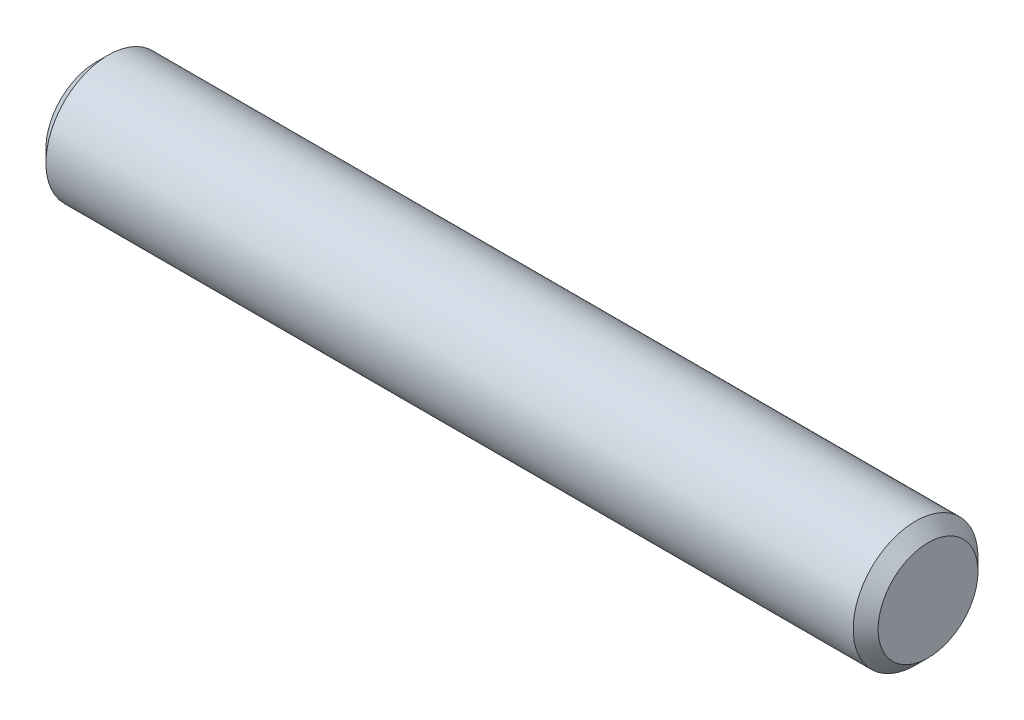
ISO-10303-21;
HEADER;
FILE_DESCRIPTION(('STEP AP214'),'2;1');
FILE_NAME('part.step','',(''),(''),'','','');
FILE_SCHEMA(('AUTOMOTIVE_DESIGN { 1 0 10303 214 1 1 1 1 }'));
ENDSEC;
DATA;
#1=APPLICATION_CONTEXT('core data for automotive mechanical design processes');
#2=APPLICATION_PROTOCOL_DEFINITION('international standard','automotive_design',2000,#1);
#3=PRODUCT_CONTEXT('',#1,'mechanical');
#4=PRODUCT('Part','Part','',(#3));
#5=PRODUCT_RELATED_PRODUCT_CATEGORY('part','',(#4));
#6=PRODUCT_DEFINITION_FORMATION('','',#4);
#7=PRODUCT_DEFINITION_CONTEXT('part definition',#1,'design');
#8=PRODUCT_DEFINITION('design','',#6,#7);
#9=PRODUCT_DEFINITION_SHAPE('','',#8);
#10=(LENGTH_UNIT() NAMED_UNIT(*) SI_UNIT(.MILLI.,.METRE.));
#11=(NAMED_UNIT(*) PLANE_ANGLE_UNIT() SI_UNIT($,.RADIAN.));
#12=(NAMED_UNIT(*) SI_UNIT($,.STERADIAN.) SOLID_ANGLE_UNIT());
#13=UNCERTAINTY_MEASURE_WITH_UNIT(LENGTH_MEASURE(1.E-05),#10,'distance_accuracy_value','');
#14=(GEOMETRIC_REPRESENTATION_CONTEXT(3) GLOBAL_UNCERTAINTY_ASSIGNED_CONTEXT((#13)) GLOBAL_UNIT_ASSIGNED_CONTEXT((#10,
#11,#12)) REPRESENTATION_CONTEXT('',''));
#15=CARTESIAN_POINT('',(0.,0.,0.));
#16=DIRECTION('',(0.,0.,1.));
#17=DIRECTION('',(1.,0.,0.));
#18=AXIS2_PLACEMENT_3D('',#15,#16,#17);
#19=CARTESIAN_POINT('',(-10.,0.,0.));
#20=DIRECTION('',(1.,0.,0.));
#21=DIRECTION('',(0.,0.,-1.));
#22=AXIS2_PLACEMENT_3D('',#19,#20,#21);
#23=CYLINDRICAL_SURFACE('',#22,1.5);
#24=CARTESIAN_POINT('',(9.7,0.,0.));
#25=DIRECTION('',(1.,0.,0.));
#26=DIRECTION('',(0.,0.,-1.));
#27=AXIS2_PLACEMENT_3D('',#24,#25,#26);
#28=CIRCLE('',#27,1.5);
#29=CARTESIAN_POINT('',(9.7,0.,-1.5));
#30=VERTEX_POINT('',#29);
#31=EDGE_CURVE('E41',#30,#30,#28,.F.);
#32=ORIENTED_EDGE('',*,*,#31,.T.);
#33=EDGE_LOOP('',(#32));
#34=FACE_BOUND('',#33,.T.);
#35=CARTESIAN_POINT('',(-9.7,0.,0.));
#36=DIRECTION('',(1.,0.,0.));
#37=DIRECTION('',(0.,0.,-1.));
#38=AXIS2_PLACEMENT_3D('',#35,#36,#37);
#39=CIRCLE('',#38,1.5);
#40=CARTESIAN_POINT('',(-9.7,0.,-1.5));
#41=VERTEX_POINT('',#40);
#42=EDGE_CURVE('E45',#41,#41,#39,.T.);
#43=ORIENTED_EDGE('',*,*,#42,.T.);
#44=EDGE_LOOP('',(#43));
#45=FACE_BOUND('',#44,.T.);
#46=ADVANCED_FACE('F34',(#34,#45),#23,.T.);
#47=CARTESIAN_POINT('',(-10.,0.,0.));
#48=DIRECTION('',(1.,0.,0.));
#49=DIRECTION('',(0.,0.,-1.));
#50=AXIS2_PLACEMENT_3D('',#47,#48,#49);
#51=PLANE('',#50);
#52=CARTESIAN_POINT('',(-10.,0.,0.));
#53=DIRECTION('',(1.,0.,0.));
#54=DIRECTION('',(0.,0.,-1.));
#55=AXIS2_PLACEMENT_3D('',#52,#53,#54);
#56=CIRCLE('',#55,1.19999999999999);
#57=CARTESIAN_POINT('',(-10.,0.,-1.19999999999999));
#58=VERTEX_POINT('',#57);
#59=EDGE_CURVE('E10',#58,#58,#56,.F.);
#60=ORIENTED_EDGE('',*,*,#59,.T.);
#61=EDGE_LOOP('',(#60));
#62=FACE_BOUND('',#61,.T.);
#63=ADVANCED_FACE('F65',(#62),#51,.F.);
#64=CARTESIAN_POINT('',(10.,0.,0.));
#65=DIRECTION('',(1.,0.,0.));
#66=DIRECTION('',(0.,0.,-1.));
#67=AXIS2_PLACEMENT_3D('',#64,#65,#66);
#68=PLANE('',#67);
#69=CARTESIAN_POINT('',(10.,0.,0.));
#70=DIRECTION('',(1.,0.,0.));
#71=DIRECTION('',(0.,0.,-1.));
#72=AXIS2_PLACEMENT_3D('',#69,#70,#71);
#73=CIRCLE('',#72,1.2);
#74=CARTESIAN_POINT('',(10.,0.,-1.2));
#75=VERTEX_POINT('',#74);
#76=EDGE_CURVE('E49',#75,#75,#73,.T.);
#77=ORIENTED_EDGE('',*,*,#76,.T.);
#78=EDGE_LOOP('',(#77));
#79=FACE_BOUND('',#78,.T.);
#80=ADVANCED_FACE('F55',(#79),#68,.T.);
#81=CARTESIAN_POINT('',(10.,0.,0.));
#82=DIRECTION('',(-1.,0.,0.));
#83=DIRECTION('',(0.,0.,1.));
#84=AXIS2_PLACEMENT_3D('',#81,#82,#83);
#85=CONICAL_SURFACE('',#84,1.2,0.785398163397444);
#86=ORIENTED_EDGE('',*,*,#31,.F.);
#87=EDGE_LOOP('',(#86));
#88=FACE_BOUND('',#87,.T.);
#89=ORIENTED_EDGE('',*,*,#76,.F.);
#90=EDGE_LOOP('',(#89));
#91=FACE_BOUND('',#90,.T.);
#92=ADVANCED_FACE('F57',(#88,#91),#85,.T.);
#93=CARTESIAN_POINT('',(-9.7,0.,0.));
#94=DIRECTION('',(1.,0.,0.));
#95=DIRECTION('',(0.,0.,-1.));
#96=AXIS2_PLACEMENT_3D('',#93,#94,#95);
#97=CONICAL_SURFACE('',#96,1.5,0.785398163397453);
#98=ORIENTED_EDGE('',*,*,#59,.F.);
#99=EDGE_LOOP('',(#98));
#100=FACE_BOUND('',#99,.T.);
#101=ORIENTED_EDGE('',*,*,#42,.F.);
#102=EDGE_LOOP('',(#101));
#103=FACE_BOUND('',#102,.T.);
#104=ADVANCED_FACE('F36',(#100,#103),#97,.T.);
#105=CLOSED_SHELL('',(#46,#63,#80,#92,#104));
#106=MANIFOLD_SOLID_BREP('B2',#105);
#107=ADVANCED_BREP_SHAPE_REPRESENTATION('',(#18,#106),#14);
#108=SHAPE_DEFINITION_REPRESENTATION(#9,#107);
ENDSEC;
END-ISO-10303-21;
